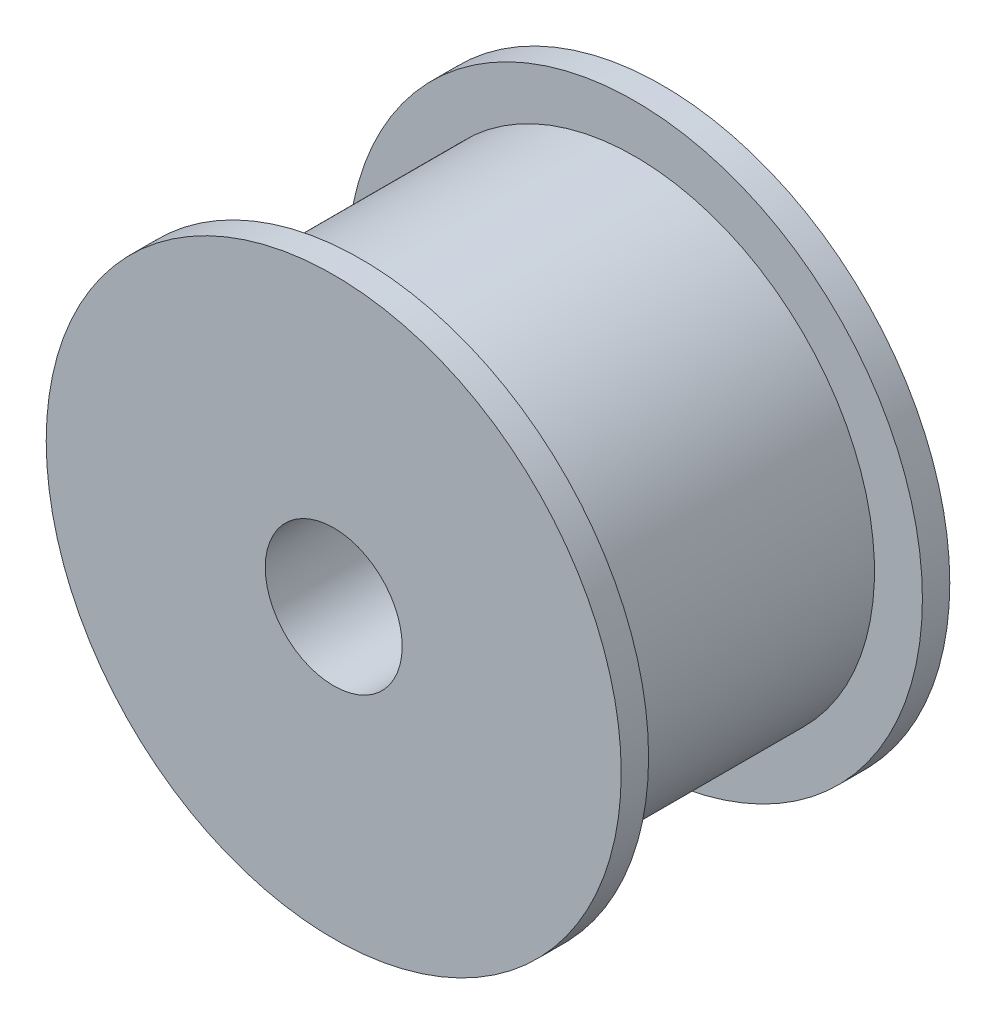
ISO-10303-21;
HEADER;
FILE_DESCRIPTION(('STEP AP214'),'2;1');
FILE_NAME('part.step','',(''),(''),'','','');
FILE_SCHEMA(('AUTOMOTIVE_DESIGN { 1 0 10303 214 1 1 1 1 }'));
ENDSEC;
DATA;
#1=APPLICATION_CONTEXT('core data for automotive mechanical design processes');
#2=APPLICATION_PROTOCOL_DEFINITION('international standard','automotive_design',2000,#1);
#3=PRODUCT_CONTEXT('',#1,'mechanical');
#4=PRODUCT('Part','Part','',(#3));
#5=PRODUCT_RELATED_PRODUCT_CATEGORY('part','',(#4));
#6=PRODUCT_DEFINITION_FORMATION('','',#4);
#7=PRODUCT_DEFINITION_CONTEXT('part definition',#1,'design');
#8=PRODUCT_DEFINITION('design','',#6,#7);
#9=PRODUCT_DEFINITION_SHAPE('','',#8);
#10=(LENGTH_UNIT() NAMED_UNIT(*) SI_UNIT(.MILLI.,.METRE.));
#11=(NAMED_UNIT(*) PLANE_ANGLE_UNIT() SI_UNIT($,.RADIAN.));
#12=(NAMED_UNIT(*) SI_UNIT($,.STERADIAN.) SOLID_ANGLE_UNIT());
#13=UNCERTAINTY_MEASURE_WITH_UNIT(LENGTH_MEASURE(1.E-05),#10,'distance_accuracy_value','');
#14=(GEOMETRIC_REPRESENTATION_CONTEXT(3) GLOBAL_UNCERTAINTY_ASSIGNED_CONTEXT((#13)) GLOBAL_UNIT_ASSIGNED_CONTEXT((#10,
#11,#12)) REPRESENTATION_CONTEXT('',''));
#15=CARTESIAN_POINT('',(0.,0.,0.));
#16=DIRECTION('',(0.,0.,1.));
#17=DIRECTION('',(1.,0.,0.));
#18=AXIS2_PLACEMENT_3D('',#15,#16,#17);
#19=CARTESIAN_POINT('',(0.,0.,1.));
#20=DIRECTION('',(0.,0.,-1.));
#21=DIRECTION('',(-1.,0.,0.));
#22=AXIS2_PLACEMENT_3D('',#19,#20,#21);
#23=CYLINDRICAL_SURFACE('',#22,2.5);
#24=CARTESIAN_POINT('',(0.,0.,1.));
#25=DIRECTION('',(0.,0.,1.));
#26=DIRECTION('',(1.,0.,0.));
#27=AXIS2_PLACEMENT_3D('',#24,#25,#26);
#28=CIRCLE('',#27,2.5);
#29=CARTESIAN_POINT('',(2.5,0.,1.));
#30=VERTEX_POINT('',#29);
#31=EDGE_CURVE('E48',#30,#30,#28,.T.);
#32=ORIENTED_EDGE('',*,*,#31,.T.);
#33=EDGE_LOOP('',(#32));
#34=FACE_BOUND('',#33,.T.);
#35=CARTESIAN_POINT('',(0.,0.,-11.));
#36=DIRECTION('',(0.,0.,-1.));
#37=DIRECTION('',(-1.,0.,0.));
#38=AXIS2_PLACEMENT_3D('',#35,#36,#37);
#39=CIRCLE('',#38,2.5);
#40=CARTESIAN_POINT('',(-2.5,0.,-11.));
#41=VERTEX_POINT('',#40);
#42=EDGE_CURVE('E69',#41,#41,#39,.T.);
#43=ORIENTED_EDGE('',*,*,#42,.T.);
#44=EDGE_LOOP('',(#43));
#45=FACE_BOUND('',#44,.T.);
#46=ADVANCED_FACE('F36',(#34,#45),#23,.F.);
#47=CARTESIAN_POINT('',(0.,0.,1.));
#48=DIRECTION('',(0.,0.,-1.));
#49=DIRECTION('',(-1.,0.,0.));
#50=AXIS2_PLACEMENT_3D('',#47,#48,#49);
#51=CYLINDRICAL_SURFACE('',#50,10.5);
#52=CARTESIAN_POINT('',(0.,0.,1.));
#53=DIRECTION('',(0.,0.,1.));
#54=DIRECTION('',(1.,0.,0.));
#55=AXIS2_PLACEMENT_3D('',#52,#53,#54);
#56=CIRCLE('',#55,10.5);
#57=CARTESIAN_POINT('',(10.5,0.,1.));
#58=VERTEX_POINT('',#57);
#59=EDGE_CURVE('E43',#58,#58,#56,.T.);
#60=ORIENTED_EDGE('',*,*,#59,.F.);
#61=EDGE_LOOP('',(#60));
#62=FACE_BOUND('',#61,.T.);
#63=CARTESIAN_POINT('',(0.,0.,0.));
#64=DIRECTION('',(0.,0.,1.));
#65=DIRECTION('',(1.,0.,0.));
#66=AXIS2_PLACEMENT_3D('',#63,#64,#65);
#67=CIRCLE('',#66,10.5);
#68=CARTESIAN_POINT('',(10.5,0.,0.));
#69=VERTEX_POINT('',#68);
#70=EDGE_CURVE('E39',#69,#69,#67,.T.);
#71=ORIENTED_EDGE('',*,*,#70,.T.);
#72=EDGE_LOOP('',(#71));
#73=FACE_BOUND('',#72,.T.);
#74=ADVANCED_FACE('F90',(#62,#73),#51,.T.);
#75=CARTESIAN_POINT('',(0.,0.,1.));
#76=DIRECTION('',(0.,0.,1.));
#77=DIRECTION('',(1.,0.,0.));
#78=AXIS2_PLACEMENT_3D('',#75,#76,#77);
#79=PLANE('',#78);
#80=ORIENTED_EDGE('',*,*,#31,.F.);
#81=EDGE_LOOP('',(#80));
#82=FACE_BOUND('',#81,.T.);
#83=ORIENTED_EDGE('',*,*,#59,.T.);
#84=EDGE_LOOP('',(#83));
#85=FACE_BOUND('',#84,.T.);
#86=ADVANCED_FACE('F94',(#82,#85),#79,.T.);
#87=CARTESIAN_POINT('',(0.,0.,0.));
#88=DIRECTION('',(0.,0.,1.));
#89=DIRECTION('',(1.,0.,0.));
#90=AXIS2_PLACEMENT_3D('',#87,#88,#89);
#91=PLANE('',#90);
#92=CARTESIAN_POINT('',(0.,0.,0.));
#93=DIRECTION('',(0.,0.,-1.));
#94=DIRECTION('',(-1.,0.,0.));
#95=AXIS2_PLACEMENT_3D('',#92,#93,#94);
#96=CIRCLE('',#95,8.75);
#97=CARTESIAN_POINT('',(-8.75,0.,0.));
#98=VERTEX_POINT('',#97);
#99=EDGE_CURVE('E10',#98,#98,#96,.T.);
#100=ORIENTED_EDGE('',*,*,#99,.F.);
#101=EDGE_LOOP('',(#100));
#102=FACE_BOUND('',#101,.T.);
#103=ORIENTED_EDGE('',*,*,#70,.F.);
#104=EDGE_LOOP('',(#103));
#105=FACE_BOUND('',#104,.T.);
#106=ADVANCED_FACE('F86',(#102,#105),#91,.F.);
#107=CARTESIAN_POINT('',(0.,0.,-10.));
#108=DIRECTION('',(0.,0.,1.));
#109=DIRECTION('',(1.,0.,0.));
#110=AXIS2_PLACEMENT_3D('',#107,#108,#109);
#111=CYLINDRICAL_SURFACE('',#110,8.75);
#112=CARTESIAN_POINT('',(0.,0.,-10.));
#113=DIRECTION('',(0.,0.,-1.));
#114=DIRECTION('',(-1.,0.,0.));
#115=AXIS2_PLACEMENT_3D('',#112,#113,#114);
#116=CIRCLE('',#115,8.75);
#117=CARTESIAN_POINT('',(-8.75,0.,-10.));
#118=VERTEX_POINT('',#117);
#119=EDGE_CURVE('E51',#118,#118,#116,.T.);
#120=ORIENTED_EDGE('',*,*,#119,.F.);
#121=EDGE_LOOP('',(#120));
#122=FACE_BOUND('',#121,.T.);
#123=ORIENTED_EDGE('',*,*,#99,.T.);
#124=EDGE_LOOP('',(#123));
#125=FACE_BOUND('',#124,.T.);
#126=ADVANCED_FACE('F78',(#122,#125),#111,.T.);
#127=CARTESIAN_POINT('',(0.,0.,-11.));
#128=DIRECTION('',(0.,0.,-1.));
#129=DIRECTION('',(-1.,0.,0.));
#130=AXIS2_PLACEMENT_3D('',#127,#128,#129);
#131=PLANE('',#130);
#132=CARTESIAN_POINT('',(0.,0.,-11.));
#133=DIRECTION('',(0.,0.,-1.));
#134=DIRECTION('',(-1.,0.,0.));
#135=AXIS2_PLACEMENT_3D('',#132,#133,#134);
#136=CIRCLE('',#135,10.5);
#137=CARTESIAN_POINT('',(-10.5,0.,-11.));
#138=VERTEX_POINT('',#137);
#139=EDGE_CURVE('E60',#138,#138,#136,.T.);
#140=ORIENTED_EDGE('',*,*,#139,.T.);
#141=EDGE_LOOP('',(#140));
#142=FACE_BOUND('',#141,.T.);
#143=ORIENTED_EDGE('',*,*,#42,.F.);
#144=EDGE_LOOP('',(#143));
#145=FACE_BOUND('',#144,.T.);
#146=ADVANCED_FACE('F75',(#142,#145),#131,.T.);
#147=CARTESIAN_POINT('',(0.,0.,-10.));
#148=DIRECTION('',(0.,0.,-1.));
#149=DIRECTION('',(-1.,0.,0.));
#150=AXIS2_PLACEMENT_3D('',#147,#148,#149);
#151=PLANE('',#150);
#152=ORIENTED_EDGE('',*,*,#119,.T.);
#153=EDGE_LOOP('',(#152));
#154=FACE_BOUND('',#153,.T.);
#155=CARTESIAN_POINT('',(0.,0.,-10.));
#156=DIRECTION('',(0.,0.,-1.));
#157=DIRECTION('',(-1.,0.,0.));
#158=AXIS2_PLACEMENT_3D('',#155,#156,#157);
#159=CIRCLE('',#158,10.5);
#160=CARTESIAN_POINT('',(-10.5,0.,-10.));
#161=VERTEX_POINT('',#160);
#162=EDGE_CURVE('E64',#161,#161,#159,.T.);
#163=ORIENTED_EDGE('',*,*,#162,.F.);
#164=EDGE_LOOP('',(#163));
#165=FACE_BOUND('',#164,.T.);
#166=ADVANCED_FACE('F77',(#154,#165),#151,.F.);
#167=CARTESIAN_POINT('',(0.,0.,-11.));
#168=DIRECTION('',(0.,0.,1.));
#169=DIRECTION('',(1.,0.,0.));
#170=AXIS2_PLACEMENT_3D('',#167,#168,#169);
#171=CYLINDRICAL_SURFACE('',#170,10.5);
#172=ORIENTED_EDGE('',*,*,#139,.F.);
#173=EDGE_LOOP('',(#172));
#174=FACE_BOUND('',#173,.T.);
#175=ORIENTED_EDGE('',*,*,#162,.T.);
#176=EDGE_LOOP('',(#175));
#177=FACE_BOUND('',#176,.T.);
#178=ADVANCED_FACE('F84',(#174,#177),#171,.T.);
#179=CLOSED_SHELL('',(#46,#74,#86,#106,#126,#146,#166,#178));
#180=MANIFOLD_SOLID_BREP('B2',#179);
#181=ADVANCED_BREP_SHAPE_REPRESENTATION('',(#18,#180),#14);
#182=SHAPE_DEFINITION_REPRESENTATION(#9,#181);
ENDSEC;
END-ISO-10303-21;
